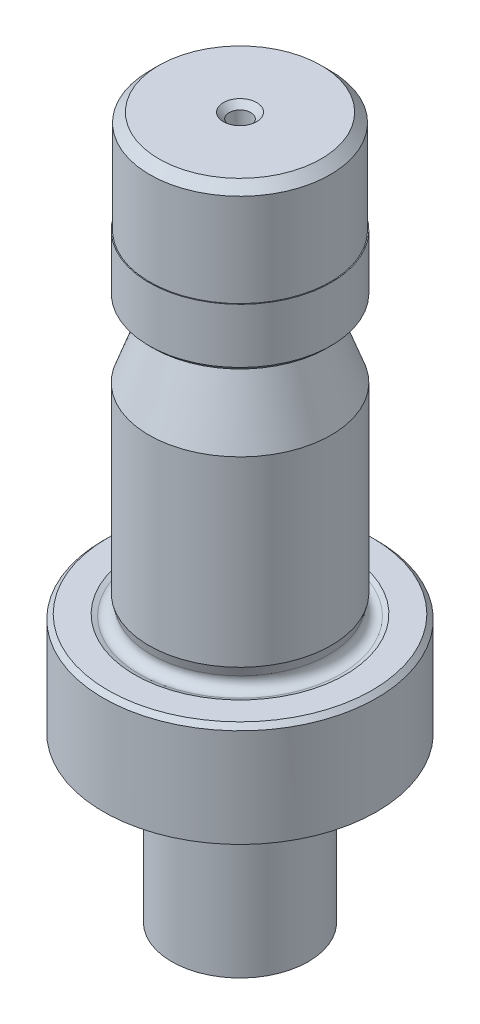
ISO-10303-21;
HEADER;
FILE_DESCRIPTION(('STEP AP214'),'2;1');
FILE_NAME('part.step','',(''),(''),'','','');
FILE_SCHEMA(('AUTOMOTIVE_DESIGN { 1 0 10303 214 1 1 1 1 }'));
ENDSEC;
DATA;
#1=APPLICATION_CONTEXT('core data for automotive mechanical design processes');
#2=APPLICATION_PROTOCOL_DEFINITION('international standard','automotive_design',2000,#1);
#3=PRODUCT_CONTEXT('',#1,'mechanical');
#4=PRODUCT('Part','Part','',(#3));
#5=PRODUCT_RELATED_PRODUCT_CATEGORY('part','',(#4));
#6=PRODUCT_DEFINITION_FORMATION('','',#4);
#7=PRODUCT_DEFINITION_CONTEXT('part definition',#1,'design');
#8=PRODUCT_DEFINITION('design','',#6,#7);
#9=PRODUCT_DEFINITION_SHAPE('','',#8);
#10=(LENGTH_UNIT() NAMED_UNIT(*) SI_UNIT(.MILLI.,.METRE.));
#11=(NAMED_UNIT(*) PLANE_ANGLE_UNIT() SI_UNIT($,.RADIAN.));
#12=(NAMED_UNIT(*) SI_UNIT($,.STERADIAN.) SOLID_ANGLE_UNIT());
#13=UNCERTAINTY_MEASURE_WITH_UNIT(LENGTH_MEASURE(1.E-05),#10,'distance_accuracy_value','');
#14=(GEOMETRIC_REPRESENTATION_CONTEXT(3) GLOBAL_UNCERTAINTY_ASSIGNED_CONTEXT((#13)) GLOBAL_UNIT_ASSIGNED_CONTEXT((#10,
#11,#12)) REPRESENTATION_CONTEXT('',''));
#15=CARTESIAN_POINT('',(0.,0.,0.));
#16=DIRECTION('',(0.,0.,1.));
#17=DIRECTION('',(1.,0.,0.));
#18=AXIS2_PLACEMENT_3D('',#15,#16,#17);
#19=CARTESIAN_POINT('',(0.,77.,0.));
#20=DIRECTION('',(0.,1.,0.));
#21=DIRECTION('',(-1.,0.,0.));
#22=AXIS2_PLACEMENT_3D('',#19,#20,#21);
#23=CYLINDRICAL_SURFACE('',#22,15.);
#24=CARTESIAN_POINT('',(0.,28.8,0.));
#25=DIRECTION('',(0.,1.,0.));
#26=DIRECTION('',(-1.,0.,0.));
#27=AXIS2_PLACEMENT_3D('',#24,#25,#26);
#28=CIRCLE('',#27,15.);
#29=CARTESIAN_POINT('',(-15.,28.8,0.));
#30=VERTEX_POINT('',#29);
#31=EDGE_CURVE('E105',#30,#30,#28,.T.);
#32=ORIENTED_EDGE('',*,*,#31,.F.);
#33=EDGE_LOOP('',(#32));
#34=FACE_BOUND('',#33,.T.);
#35=CARTESIAN_POINT('',(0.,18.,0.));
#36=DIRECTION('',(0.,-1.,0.));
#37=DIRECTION('',(1.,0.,0.));
#38=AXIS2_PLACEMENT_3D('',#35,#36,#37);
#39=CIRCLE('',#38,15.);
#40=CARTESIAN_POINT('',(15.,18.,0.));
#41=VERTEX_POINT('',#40);
#42=EDGE_CURVE('E108',#41,#41,#39,.T.);
#43=ORIENTED_EDGE('',*,*,#42,.F.);
#44=EDGE_LOOP('',(#43));
#45=FACE_BOUND('',#44,.T.);
#46=ADVANCED_FACE('F36',(#34,#45),#23,.T.);
#47=CARTESIAN_POINT('',(0.,28.8,0.));
#48=DIRECTION('',(0.,-1.,0.));
#49=DIRECTION('',(1.,0.,0.));
#50=AXIS2_PLACEMENT_3D('',#47,#48,#49);
#51=CONICAL_SURFACE('',#50,15.,0.785398163397442);
#52=CARTESIAN_POINT('',(0.,29.3,0.));
#53=DIRECTION('',(0.,1.,0.));
#54=DIRECTION('',(-1.,0.,0.));
#55=AXIS2_PLACEMENT_3D('',#52,#53,#54);
#56=CIRCLE('',#55,14.5);
#57=CARTESIAN_POINT('',(-14.5,29.3,0.));
#58=VERTEX_POINT('',#57);
#59=EDGE_CURVE('E102',#58,#58,#56,.T.);
#60=ORIENTED_EDGE('',*,*,#59,.F.);
#61=EDGE_LOOP('',(#60));
#62=FACE_BOUND('',#61,.T.);
#63=ORIENTED_EDGE('',*,*,#31,.T.);
#64=EDGE_LOOP('',(#63));
#65=FACE_BOUND('',#64,.T.);
#66=ADVANCED_FACE('F126',(#62,#65),#51,.T.);
#67=CARTESIAN_POINT('',(11.556812590135,29.3,0.));
#68=DIRECTION('',(0.,-1.,0.));
#69=DIRECTION('',(1.,0.,0.));
#70=AXIS2_PLACEMENT_3D('',#67,#68,#69);
#71=PLANE('',#70);
#72=CARTESIAN_POINT('',(0.,29.3,0.));
#73=DIRECTION('',(0.,1.,0.));
#74=DIRECTION('',(-1.,0.,0.));
#75=AXIS2_PLACEMENT_3D('',#72,#73,#74);
#76=CIRCLE('',#75,11.556812590135);
#77=CARTESIAN_POINT('',(-11.556812590135,29.3,0.));
#78=VERTEX_POINT('',#77);
#79=EDGE_CURVE('E99',#78,#78,#76,.T.);
#80=ORIENTED_EDGE('',*,*,#79,.F.);
#81=EDGE_LOOP('',(#80));
#82=FACE_BOUND('',#81,.T.);
#83=ORIENTED_EDGE('',*,*,#59,.T.);
#84=EDGE_LOOP('',(#83));
#85=FACE_BOUND('',#84,.T.);
#86=ADVANCED_FACE('F132',(#82,#85),#71,.F.);
#87=CARTESIAN_POINT('',(0.,29.3,0.));
#88=DIRECTION('',(0.,1.,0.));
#89=DIRECTION('',(-1.,0.,0.));
#90=AXIS2_PLACEMENT_3D('',#87,#88,#89);
#91=CONICAL_SURFACE('',#90,11.556812590135,1.20377583254456);
#92=CARTESIAN_POINT('',(0.,29.1077803139706,0.));
#93=DIRECTION('',(0.,1.,0.));
#94=DIRECTION('',(-1.,0.,0.));
#95=AXIS2_PLACEMENT_3D('',#92,#93,#94);
#96=CIRCLE('',#95,11.056812590135);
#97=CARTESIAN_POINT('',(-11.056812590135,29.1077803139706,0.));
#98=VERTEX_POINT('',#97);
#99=EDGE_CURVE('E96',#98,#98,#96,.T.);
#100=ORIENTED_EDGE('',*,*,#99,.F.);
#101=EDGE_LOOP('',(#100));
#102=FACE_BOUND('',#101,.T.);
#103=ORIENTED_EDGE('',*,*,#79,.T.);
#104=EDGE_LOOP('',(#103));
#105=FACE_BOUND('',#104,.T.);
#106=ADVANCED_FACE('F140',(#102,#105),#91,.F.);
#107=CARTESIAN_POINT('',(0.,30.0411809548975,0.));
#108=DIRECTION('',(0.,1.,0.));
#109=DIRECTION('',(-1.,0.,0.));
#110=AXIS2_PLACEMENT_3D('',#107,#108,#109);
#111=TOROIDAL_SURFACE('',#110,10.6979766338579,1.);
#112=CARTESIAN_POINT('',(0.,30.3,0.));
#113=DIRECTION('',(0.,1.,0.));
#114=DIRECTION('',(-1.,0.,0.));
#115=AXIS2_PLACEMENT_3D('',#112,#113,#114);
#116=CIRCLE('',#115,9.73205080756882);
#117=CARTESIAN_POINT('',(-9.73205080756882,30.3,0.));
#118=VERTEX_POINT('',#117);
#119=EDGE_CURVE('E93',#118,#118,#116,.T.);
#120=ORIENTED_EDGE('',*,*,#119,.F.);
#121=EDGE_LOOP('',(#120));
#122=FACE_BOUND('',#121,.T.);
#123=ORIENTED_EDGE('',*,*,#99,.T.);
#124=EDGE_LOOP('',(#123));
#125=FACE_BOUND('',#124,.T.);
#126=ADVANCED_FACE('F144',(#122,#125),#111,.F.);
#127=CARTESIAN_POINT('',(0.,30.3,0.));
#128=DIRECTION('',(0.,1.,0.));
#129=DIRECTION('',(-1.,0.,0.));
#130=AXIS2_PLACEMENT_3D('',#127,#128,#129);
#131=CONICAL_SURFACE('',#130,9.73205080756882,0.261799387799151);
#132=CARTESIAN_POINT('',(0.,31.3,0.));
#133=DIRECTION('',(0.,1.,0.));
#134=DIRECTION('',(-1.,0.,0.));
#135=AXIS2_PLACEMENT_3D('',#132,#133,#134);
#136=CIRCLE('',#135,9.99999999999994);
#137=CARTESIAN_POINT('',(-9.99999999999994,31.3,0.));
#138=VERTEX_POINT('',#137);
#139=EDGE_CURVE('E90',#138,#138,#136,.T.);
#140=ORIENTED_EDGE('',*,*,#139,.F.);
#141=EDGE_LOOP('',(#140));
#142=FACE_BOUND('',#141,.T.);
#143=ORIENTED_EDGE('',*,*,#119,.T.);
#144=EDGE_LOOP('',(#143));
#145=FACE_BOUND('',#144,.T.);
#146=ADVANCED_FACE('F148',(#142,#145),#131,.T.);
#147=CARTESIAN_POINT('',(0.,77.,0.));
#148=DIRECTION('',(0.,1.,0.));
#149=DIRECTION('',(-1.,0.,0.));
#150=AXIS2_PLACEMENT_3D('',#147,#148,#149);
#151=CYLINDRICAL_SURFACE('',#150,9.99999999999997);
#152=CARTESIAN_POINT('',(0.,51.3,0.));
#153=DIRECTION('',(0.,1.,0.));
#154=DIRECTION('',(-1.,0.,0.));
#155=AXIS2_PLACEMENT_3D('',#152,#153,#154);
#156=CIRCLE('',#155,9.99999999999999);
#157=CARTESIAN_POINT('',(-9.99999999999999,51.3,0.));
#158=VERTEX_POINT('',#157);
#159=EDGE_CURVE('E87',#158,#158,#156,.T.);
#160=ORIENTED_EDGE('',*,*,#159,.F.);
#161=EDGE_LOOP('',(#160));
#162=FACE_BOUND('',#161,.T.);
#163=ORIENTED_EDGE('',*,*,#139,.T.);
#164=EDGE_LOOP('',(#163));
#165=FACE_BOUND('',#164,.T.);
#166=ADVANCED_FACE('F152',(#162,#165),#151,.T.);
#167=CARTESIAN_POINT('',(0.,51.3,0.));
#168=DIRECTION('',(0.,-1.,0.));
#169=DIRECTION('',(1.,0.,0.));
#170=AXIS2_PLACEMENT_3D('',#167,#168,#169);
#171=CONICAL_SURFACE('',#170,9.99999999999999,0.349065850398866);
#172=CARTESIAN_POINT('',(0.,57.9579798566743,0.));
#173=DIRECTION('',(0.,1.,0.));
#174=DIRECTION('',(-1.,0.,0.));
#175=AXIS2_PLACEMENT_3D('',#172,#173,#174);
#176=CIRCLE('',#175,7.57669351182658);
#177=CARTESIAN_POINT('',(-7.57669351182658,57.9579798566743,0.));
#178=VERTEX_POINT('',#177);
#179=EDGE_CURVE('E84',#178,#178,#176,.T.);
#180=ORIENTED_EDGE('',*,*,#179,.F.);
#181=EDGE_LOOP('',(#180));
#182=FACE_BOUND('',#181,.T.);
#183=ORIENTED_EDGE('',*,*,#159,.T.);
#184=EDGE_LOOP('',(#183));
#185=FACE_BOUND('',#184,.T.);
#186=ADVANCED_FACE('F156',(#182,#185),#171,.T.);
#187=CARTESIAN_POINT('',(0.,58.3,0.));
#188=DIRECTION('',(0.,1.,0.));
#189=DIRECTION('',(-1.,0.,0.));
#190=AXIS2_PLACEMENT_3D('',#187,#188,#189);
#191=TOROIDAL_SURFACE('',#190,8.51638613261248,0.999999999999996);
#192=CARTESIAN_POINT('',(0.,59.3,0.));
#193=DIRECTION('',(0.,1.,0.));
#194=DIRECTION('',(-1.,0.,0.));
#195=AXIS2_PLACEMENT_3D('',#192,#193,#194);
#196=CIRCLE('',#195,8.51638613261248);
#197=CARTESIAN_POINT('',(-8.51638613261248,59.3,0.));
#198=VERTEX_POINT('',#197);
#199=EDGE_CURVE('E81',#198,#198,#196,.T.);
#200=ORIENTED_EDGE('',*,*,#199,.F.);
#201=EDGE_LOOP('',(#200));
#202=FACE_BOUND('',#201,.T.);
#203=ORIENTED_EDGE('',*,*,#179,.T.);
#204=EDGE_LOOP('',(#203));
#205=FACE_BOUND('',#204,.T.);
#206=ADVANCED_FACE('F160',(#202,#205),#191,.F.);
#207=CARTESIAN_POINT('',(9.5,59.3,0.));
#208=DIRECTION('',(0.,1.,0.));
#209=DIRECTION('',(-1.,0.,0.));
#210=AXIS2_PLACEMENT_3D('',#207,#208,#209);
#211=PLANE('',#210);
#212=CARTESIAN_POINT('',(0.,59.3,0.));
#213=DIRECTION('',(0.,1.,0.));
#214=DIRECTION('',(-1.,0.,0.));
#215=AXIS2_PLACEMENT_3D('',#212,#213,#214);
#216=CIRCLE('',#215,9.5);
#217=CARTESIAN_POINT('',(-9.5,59.3,0.));
#218=VERTEX_POINT('',#217);
#219=EDGE_CURVE('E78',#218,#218,#216,.T.);
#220=ORIENTED_EDGE('',*,*,#219,.F.);
#221=EDGE_LOOP('',(#220));
#222=FACE_BOUND('',#221,.T.);
#223=ORIENTED_EDGE('',*,*,#199,.T.);
#224=EDGE_LOOP('',(#223));
#225=FACE_BOUND('',#224,.T.);
#226=ADVANCED_FACE('F164',(#222,#225),#211,.F.);
#227=CARTESIAN_POINT('',(0.,59.3,0.));
#228=DIRECTION('',(0.,1.,0.));
#229=DIRECTION('',(-1.,0.,0.));
#230=AXIS2_PLACEMENT_3D('',#227,#228,#229);
#231=CONICAL_SURFACE('',#230,9.5,0.785398163397445);
#232=CARTESIAN_POINT('',(0.,59.8,0.));
#233=DIRECTION('',(0.,1.,0.));
#234=DIRECTION('',(-1.,0.,0.));
#235=AXIS2_PLACEMENT_3D('',#232,#233,#234);
#236=CIRCLE('',#235,10.);
#237=CARTESIAN_POINT('',(-10.,59.8,0.));
#238=VERTEX_POINT('',#237);
#239=EDGE_CURVE('E75',#238,#238,#236,.T.);
#240=ORIENTED_EDGE('',*,*,#239,.F.);
#241=EDGE_LOOP('',(#240));
#242=FACE_BOUND('',#241,.T.);
#243=ORIENTED_EDGE('',*,*,#219,.T.);
#244=EDGE_LOOP('',(#243));
#245=FACE_BOUND('',#244,.T.);
#246=ADVANCED_FACE('F168',(#242,#245),#231,.T.);
#247=CARTESIAN_POINT('',(0.,77.,0.));
#248=DIRECTION('',(0.,1.,0.));
#249=DIRECTION('',(-1.,0.,0.));
#250=AXIS2_PLACEMENT_3D('',#247,#248,#249);
#251=CYLINDRICAL_SURFACE('',#250,10.);
#252=CARTESIAN_POINT('',(0.,65.8,0.));
#253=DIRECTION('',(0.,1.,0.));
#254=DIRECTION('',(-1.,0.,0.));
#255=AXIS2_PLACEMENT_3D('',#252,#253,#254);
#256=CIRCLE('',#255,10.);
#257=CARTESIAN_POINT('',(-10.,65.8,0.));
#258=VERTEX_POINT('',#257);
#259=EDGE_CURVE('E72',#258,#258,#256,.T.);
#260=ORIENTED_EDGE('',*,*,#259,.F.);
#261=EDGE_LOOP('',(#260));
#262=FACE_BOUND('',#261,.T.);
#263=ORIENTED_EDGE('',*,*,#239,.T.);
#264=EDGE_LOOP('',(#263));
#265=FACE_BOUND('',#264,.T.);
#266=ADVANCED_FACE('F172',(#262,#265),#251,.T.);
#267=CARTESIAN_POINT('',(9.9,65.8,0.));
#268=DIRECTION('',(0.,-1.,0.));
#269=DIRECTION('',(1.,0.,0.));
#270=AXIS2_PLACEMENT_3D('',#267,#268,#269);
#271=PLANE('',#270);
#272=CARTESIAN_POINT('',(0.,65.8,0.));
#273=DIRECTION('',(0.,1.,0.));
#274=DIRECTION('',(-1.,0.,0.));
#275=AXIS2_PLACEMENT_3D('',#272,#273,#274);
#276=CIRCLE('',#275,9.9);
#277=CARTESIAN_POINT('',(-9.9,65.8,0.));
#278=VERTEX_POINT('',#277);
#279=EDGE_CURVE('E69',#278,#278,#276,.T.);
#280=ORIENTED_EDGE('',*,*,#279,.F.);
#281=EDGE_LOOP('',(#280));
#282=FACE_BOUND('',#281,.T.);
#283=ORIENTED_EDGE('',*,*,#259,.T.);
#284=EDGE_LOOP('',(#283));
#285=FACE_BOUND('',#284,.T.);
#286=ADVANCED_FACE('F176',(#282,#285),#271,.F.);
#287=CARTESIAN_POINT('',(0.,77.,0.));
#288=DIRECTION('',(0.,1.,0.));
#289=DIRECTION('',(-1.,0.,0.));
#290=AXIS2_PLACEMENT_3D('',#287,#288,#289);
#291=CYLINDRICAL_SURFACE('',#290,9.9);
#292=CARTESIAN_POINT('',(0.,76.,0.));
#293=DIRECTION('',(0.,1.,0.));
#294=DIRECTION('',(-1.,0.,0.));
#295=AXIS2_PLACEMENT_3D('',#292,#293,#294);
#296=CIRCLE('',#295,9.9);
#297=CARTESIAN_POINT('',(-9.9,76.,0.));
#298=VERTEX_POINT('',#297);
#299=EDGE_CURVE('E60',#298,#298,#296,.T.);
#300=ORIENTED_EDGE('',*,*,#299,.F.);
#301=EDGE_LOOP('',(#300));
#302=FACE_BOUND('',#301,.T.);
#303=ORIENTED_EDGE('',*,*,#279,.T.);
#304=EDGE_LOOP('',(#303));
#305=FACE_BOUND('',#304,.T.);
#306=ADVANCED_FACE('F180',(#302,#305),#291,.T.);
#307=CARTESIAN_POINT('',(0.,76.,0.));
#308=DIRECTION('',(0.,-1.,0.));
#309=DIRECTION('',(1.,0.,0.));
#310=AXIS2_PLACEMENT_3D('',#307,#308,#309);
#311=CONICAL_SURFACE('',#310,9.9,0.785398163397447);
#312=CARTESIAN_POINT('',(0.,77.,0.));
#313=DIRECTION('',(0.,1.,0.));
#314=DIRECTION('',(-1.,0.,0.));
#315=AXIS2_PLACEMENT_3D('',#312,#313,#314);
#316=CIRCLE('',#315,8.9);
#317=CARTESIAN_POINT('',(-8.9,77.,0.));
#318=VERTEX_POINT('',#317);
#319=EDGE_CURVE('E56',#318,#318,#316,.T.);
#320=ORIENTED_EDGE('',*,*,#319,.F.);
#321=EDGE_LOOP('',(#320));
#322=FACE_BOUND('',#321,.T.);
#323=ORIENTED_EDGE('',*,*,#299,.T.);
#324=EDGE_LOOP('',(#323));
#325=FACE_BOUND('',#324,.T.);
#326=ADVANCED_FACE('F184',(#322,#325),#311,.T.);
#327=CARTESIAN_POINT('',(0.,77.,0.));
#328=DIRECTION('',(0.,-1.,0.));
#329=DIRECTION('',(1.,0.,0.));
#330=AXIS2_PLACEMENT_3D('',#327,#328,#329);
#331=PLANE('',#330);
#332=CARTESIAN_POINT('',(0.,77.,0.));
#333=DIRECTION('',(0.,1.,0.));
#334=DIRECTION('',(0.,0.,1.));
#335=AXIS2_PLACEMENT_3D('',#332,#333,#334);
#336=CIRCLE('',#335,1.825625);
#337=CARTESIAN_POINT('',(0.,77.,1.825625));
#338=VERTEX_POINT('',#337);
#339=EDGE_CURVE('E63',#338,#338,#336,.T.);
#340=ORIENTED_EDGE('',*,*,#339,.F.);
#341=EDGE_LOOP('',(#340));
#342=FACE_BOUND('',#341,.T.);
#343=ORIENTED_EDGE('',*,*,#319,.T.);
#344=EDGE_LOOP('',(#343));
#345=FACE_BOUND('',#344,.T.);
#346=ADVANCED_FACE('F50',(#342,#345),#331,.F.);
#347=CARTESIAN_POINT('',(0.,74.,0.));
#348=DIRECTION('',(0.,1.,0.));
#349=DIRECTION('',(0.,0.,1.));
#350=AXIS2_PLACEMENT_3D('',#347,#348,#349);
#351=CONICAL_SURFACE('',#350,1.19062499999999,1.02974425867665);
#352=CARTESIAN_POINT('',(0.,73.2846003254703,0.));
#353=VERTEX_POINT('',#352);
#354=VERTEX_LOOP('',#353);
#355=FACE_BOUND('',#354,.T.);
#356=CARTESIAN_POINT('',(0.,74.,0.));
#357=DIRECTION('',(0.,1.,0.));
#358=DIRECTION('',(0.,0.,1.));
#359=AXIS2_PLACEMENT_3D('',#356,#357,#358);
#360=CIRCLE('',#359,1.19062499999999);
#361=CARTESIAN_POINT('',(0.,74.,1.19062499999999));
#362=VERTEX_POINT('',#361);
#363=EDGE_CURVE('E54',#362,#362,#360,.T.);
#364=ORIENTED_EDGE('',*,*,#363,.T.);
#365=EDGE_LOOP('',(#364));
#366=FACE_BOUND('',#365,.T.);
#367=ADVANCED_FACE('F46',(#355,#366),#351,.F.);
#368=CARTESIAN_POINT('',(0.,77.,0.));
#369=DIRECTION('',(0.,1.,0.));
#370=DIRECTION('',(0.,0.,1.));
#371=AXIS2_PLACEMENT_3D('',#368,#369,#370);
#372=CYLINDRICAL_SURFACE('',#371,1.19062499999999);
#373=ORIENTED_EDGE('',*,*,#363,.F.);
#374=EDGE_LOOP('',(#373));
#375=FACE_BOUND('',#374,.T.);
#376=CARTESIAN_POINT('',(0.,76.365,0.));
#377=DIRECTION('',(0.,1.,0.));
#378=DIRECTION('',(0.,0.,1.));
#379=AXIS2_PLACEMENT_3D('',#376,#377,#378);
#380=CIRCLE('',#379,1.19062499999999);
#381=CARTESIAN_POINT('',(0.,76.365,1.19062499999999));
#382=VERTEX_POINT('',#381);
#383=EDGE_CURVE('E57',#382,#382,#380,.T.);
#384=ORIENTED_EDGE('',*,*,#383,.T.);
#385=EDGE_LOOP('',(#384));
#386=FACE_BOUND('',#385,.T.);
#387=ADVANCED_FACE('F49',(#375,#386),#372,.F.);
#388=CARTESIAN_POINT('',(0.,77.,0.));
#389=DIRECTION('',(0.,1.,0.));
#390=DIRECTION('',(0.,0.,1.));
#391=AXIS2_PLACEMENT_3D('',#388,#389,#390);
#392=CONICAL_SURFACE('',#391,1.825625,0.785398163397459);
#393=ORIENTED_EDGE('',*,*,#383,.F.);
#394=EDGE_LOOP('',(#393));
#395=FACE_BOUND('',#394,.T.);
#396=ORIENTED_EDGE('',*,*,#339,.T.);
#397=EDGE_LOOP('',(#396));
#398=FACE_BOUND('',#397,.T.);
#399=ADVANCED_FACE('F194',(#395,#398),#392,.F.);
#400=CARTESIAN_POINT('',(0.,18.,0.));
#401=DIRECTION('',(0.,-1.,0.));
#402=DIRECTION('',(1.,0.,0.));
#403=AXIS2_PLACEMENT_3D('',#400,#401,#402);
#404=PLANE('',#403);
#405=CARTESIAN_POINT('',(0.,18.,0.));
#406=DIRECTION('',(0.,-1.,0.));
#407=DIRECTION('',(1.,0.,0.));
#408=AXIS2_PLACEMENT_3D('',#405,#406,#407);
#409=CIRCLE('',#408,10.5);
#410=CARTESIAN_POINT('',(10.5,18.,0.));
#411=VERTEX_POINT('',#410);
#412=EDGE_CURVE('E12',#411,#411,#409,.F.);
#413=ORIENTED_EDGE('',*,*,#412,.T.);
#414=EDGE_LOOP('',(#413));
#415=FACE_BOUND('',#414,.T.);
#416=ORIENTED_EDGE('',*,*,#42,.T.);
#417=EDGE_LOOP('',(#416));
#418=FACE_BOUND('',#417,.T.);
#419=ADVANCED_FACE('F197',(#415,#418),#404,.T.);
#420=CARTESIAN_POINT('',(0.,18.,0.));
#421=DIRECTION('',(0.,-1.,0.));
#422=DIRECTION('',(1.,0.,0.));
#423=AXIS2_PLACEMENT_3D('',#420,#421,#422);
#424=CYLINDRICAL_SURFACE('',#423,7.5);
#425=CARTESIAN_POINT('',(0.,15.,0.));
#426=DIRECTION('',(0.,-1.,0.));
#427=DIRECTION('',(1.,0.,0.));
#428=AXIS2_PLACEMENT_3D('',#425,#426,#427);
#429=CIRCLE('',#428,7.5);
#430=CARTESIAN_POINT('',(7.5,15.,0.));
#431=VERTEX_POINT('',#430);
#432=EDGE_CURVE('E43',#431,#431,#429,.T.);
#433=ORIENTED_EDGE('',*,*,#432,.T.);
#434=EDGE_LOOP('',(#433));
#435=FACE_BOUND('',#434,.T.);
#436=CARTESIAN_POINT('',(0.,0.,0.));
#437=DIRECTION('',(0.,-1.,0.));
#438=DIRECTION('',(1.,0.,0.));
#439=AXIS2_PLACEMENT_3D('',#436,#437,#438);
#440=CIRCLE('',#439,7.5);
#441=CARTESIAN_POINT('',(7.5,0.,0.));
#442=VERTEX_POINT('',#441);
#443=EDGE_CURVE('E110',#442,#442,#440,.T.);
#444=ORIENTED_EDGE('',*,*,#443,.F.);
#445=EDGE_LOOP('',(#444));
#446=FACE_BOUND('',#445,.T.);
#447=ADVANCED_FACE('F114',(#435,#446),#424,.T.);
#448=CARTESIAN_POINT('',(15.,0.,0.));
#449=DIRECTION('',(0.,1.,0.));
#450=DIRECTION('',(-1.,0.,0.));
#451=AXIS2_PLACEMENT_3D('',#448,#449,#450);
#452=PLANE('',#451);
#453=ORIENTED_EDGE('',*,*,#443,.T.);
#454=EDGE_LOOP('',(#453));
#455=FACE_BOUND('',#454,.T.);
#456=ADVANCED_FACE('F118',(#455),#452,.F.);
#457=CARTESIAN_POINT('',(0.,15.,0.));
#458=DIRECTION('',(0.,-1.,0.));
#459=DIRECTION('',(1.,0.,0.));
#460=AXIS2_PLACEMENT_3D('',#457,#458,#459);
#461=TOROIDAL_SURFACE('',#460,10.5,3.);
#462=ORIENTED_EDGE('',*,*,#412,.F.);
#463=EDGE_LOOP('',(#462));
#464=FACE_BOUND('',#463,.T.);
#465=ORIENTED_EDGE('',*,*,#432,.F.);
#466=EDGE_LOOP('',(#465));
#467=FACE_BOUND('',#466,.T.);
#468=ADVANCED_FACE('F38',(#464,#467),#461,.F.);
#469=CLOSED_SHELL('',(#46,#66,#86,#106,#126,#146,#166,#186,#206,#226,#246,#266,#286,#306,#326,
#346,#367,#387,#399,#419,#447,#456,#468));
#470=MANIFOLD_SOLID_BREP('B2',#469);
#471=ADVANCED_BREP_SHAPE_REPRESENTATION('',(#18,#470),#14);
#472=SHAPE_DEFINITION_REPRESENTATION(#9,#471);
ENDSEC;
END-ISO-10303-21;
